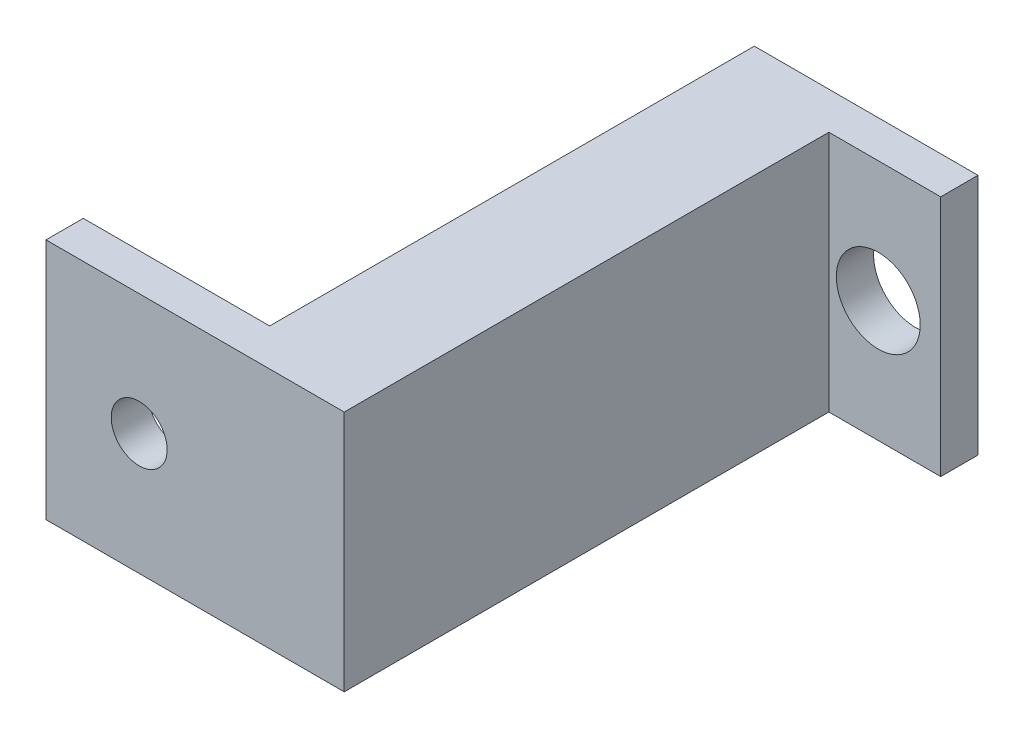
ISO-10303-21;
HEADER;
FILE_DESCRIPTION(('STEP AP214'),'2;1');
FILE_NAME('part.step','',(''),(''),'','','');
FILE_SCHEMA(('AUTOMOTIVE_DESIGN { 1 0 10303 214 1 1 1 1 }'));
ENDSEC;
DATA;
#1=APPLICATION_CONTEXT('core data for automotive mechanical design processes');
#2=APPLICATION_PROTOCOL_DEFINITION('international standard','automotive_design',2000,#1);
#3=PRODUCT_CONTEXT('',#1,'mechanical');
#4=PRODUCT('Part','Part','',(#3));
#5=PRODUCT_RELATED_PRODUCT_CATEGORY('part','',(#4));
#6=PRODUCT_DEFINITION_FORMATION('','',#4);
#7=PRODUCT_DEFINITION_CONTEXT('part definition',#1,'design');
#8=PRODUCT_DEFINITION('design','',#6,#7);
#9=PRODUCT_DEFINITION_SHAPE('','',#8);
#10=(LENGTH_UNIT() NAMED_UNIT(*) SI_UNIT(.MILLI.,.METRE.));
#11=(NAMED_UNIT(*) PLANE_ANGLE_UNIT() SI_UNIT($,.RADIAN.));
#12=(NAMED_UNIT(*) SI_UNIT($,.STERADIAN.) SOLID_ANGLE_UNIT());
#13=UNCERTAINTY_MEASURE_WITH_UNIT(LENGTH_MEASURE(1.E-05),#10,'distance_accuracy_value','');
#14=(GEOMETRIC_REPRESENTATION_CONTEXT(3) GLOBAL_UNCERTAINTY_ASSIGNED_CONTEXT((#13)) GLOBAL_UNIT_ASSIGNED_CONTEXT((#10,
#11,#12)) REPRESENTATION_CONTEXT('',''));
#15=CARTESIAN_POINT('',(0.,0.,0.));
#16=DIRECTION('',(0.,0.,1.));
#17=DIRECTION('',(1.,0.,0.));
#18=AXIS2_PLACEMENT_3D('',#15,#16,#17);
#19=CARTESIAN_POINT('',(0.,0.,2.));
#20=DIRECTION('',(0.,0.,-1.));
#21=DIRECTION('',(-1.,0.,0.));
#22=AXIS2_PLACEMENT_3D('',#19,#20,#21);
#23=PLANE('',#22);
#24=CARTESIAN_POINT('',(2.65,0.,2.));
#25=DIRECTION('',(0.,0.,1.));
#26=DIRECTION('',(1.,0.,0.));
#27=AXIS2_PLACEMENT_3D('',#24,#25,#26);
#28=CIRCLE('',#27,2.25);
#29=CARTESIAN_POINT('',(4.9,0.,2.));
#30=VERTEX_POINT('',#29);
#31=EDGE_CURVE('E105',#30,#30,#28,.T.);
#32=ORIENTED_EDGE('',*,*,#31,.F.);
#33=EDGE_LOOP('',(#32));
#34=FACE_BOUND('',#33,.T.);
#35=DIRECTION('',(0.,1.,0.));
#36=VECTOR('',#35,1.);
#37=CARTESIAN_POINT('',(0.,6.5,2.));
#38=LINE('',#37,#36);
#39=CARTESIAN_POINT('',(0.,-6.5,2.));
#40=VERTEX_POINT('',#39);
#41=CARTESIAN_POINT('',(0.,6.5,2.));
#42=VERTEX_POINT('',#41);
#43=EDGE_CURVE('E55',#40,#42,#38,.T.);
#44=ORIENTED_EDGE('',*,*,#43,.F.);
#45=DIRECTION('',(1.,0.,0.));
#46=VECTOR('',#45,1.);
#47=CARTESIAN_POINT('',(-6.,-6.5,2.));
#48=LINE('',#47,#46);
#49=CARTESIAN_POINT('',(6.,-6.5,2.));
#50=VERTEX_POINT('',#49);
#51=EDGE_CURVE('E60',#40,#50,#48,.T.);
#52=ORIENTED_EDGE('',*,*,#51,.T.);
#53=DIRECTION('',(0.,1.,0.));
#54=VECTOR('',#53,1.);
#55=CARTESIAN_POINT('',(6.,-6.5,2.));
#56=LINE('',#55,#54);
#57=CARTESIAN_POINT('',(6.,6.5,2.));
#58=VERTEX_POINT('',#57);
#59=EDGE_CURVE('E92',#50,#58,#56,.T.);
#60=ORIENTED_EDGE('',*,*,#59,.T.);
#61=DIRECTION('',(-1.,0.,0.));
#62=VECTOR('',#61,1.);
#63=CARTESIAN_POINT('',(-6.,6.5,2.));
#64=LINE('',#63,#62);
#65=EDGE_CURVE('E214',#58,#42,#64,.T.);
#66=ORIENTED_EDGE('',*,*,#65,.T.);
#67=EDGE_LOOP('',(#44,#52,#60,#66));
#68=FACE_BOUND('',#67,.T.);
#69=ADVANCED_FACE('F39',(#34,#68),#23,.F.);
#70=CARTESIAN_POINT('',(0.,0.,0.));
#71=DIRECTION('',(0.,0.,-1.));
#72=DIRECTION('',(-1.,0.,0.));
#73=AXIS2_PLACEMENT_3D('',#70,#71,#72);
#74=PLANE('',#73);
#75=DIRECTION('',(0.,1.,0.));
#76=VECTOR('',#75,1.);
#77=CARTESIAN_POINT('',(6.,-6.5,0.));
#78=LINE('',#77,#76);
#79=CARTESIAN_POINT('',(6.,-6.5,0.));
#80=VERTEX_POINT('',#79);
#81=CARTESIAN_POINT('',(6.,6.5,0.));
#82=VERTEX_POINT('',#81);
#83=EDGE_CURVE('E98',#80,#82,#78,.T.);
#84=ORIENTED_EDGE('',*,*,#83,.F.);
#85=DIRECTION('',(1.,0.,0.));
#86=VECTOR('',#85,1.);
#87=CARTESIAN_POINT('',(-6.,-6.5,0.));
#88=LINE('',#87,#86);
#89=CARTESIAN_POINT('',(-6.,-6.5,0.));
#90=VERTEX_POINT('',#89);
#91=EDGE_CURVE('E80',#90,#80,#88,.T.);
#92=ORIENTED_EDGE('',*,*,#91,.F.);
#93=DIRECTION('',(0.,-1.,0.));
#94=VECTOR('',#93,1.);
#95=CARTESIAN_POINT('',(-6.,-6.5,0.));
#96=LINE('',#95,#94);
#97=CARTESIAN_POINT('',(-6.,6.5,0.));
#98=VERTEX_POINT('',#97);
#99=EDGE_CURVE('E93',#98,#90,#96,.T.);
#100=ORIENTED_EDGE('',*,*,#99,.F.);
#101=DIRECTION('',(-1.,0.,0.));
#102=VECTOR('',#101,1.);
#103=CARTESIAN_POINT('',(-6.,6.5,0.));
#104=LINE('',#103,#102);
#105=EDGE_CURVE('E103',#82,#98,#104,.T.);
#106=ORIENTED_EDGE('',*,*,#105,.F.);
#107=EDGE_LOOP('',(#84,#92,#100,#106));
#108=FACE_BOUND('',#107,.T.);
#109=CARTESIAN_POINT('',(2.65,0.,0.));
#110=DIRECTION('',(0.,0.,1.));
#111=DIRECTION('',(1.,0.,0.));
#112=AXIS2_PLACEMENT_3D('',#109,#110,#111);
#113=CIRCLE('',#112,2.25);
#114=CARTESIAN_POINT('',(4.9,0.,0.));
#115=VERTEX_POINT('',#114);
#116=EDGE_CURVE('E111',#115,#115,#113,.T.);
#117=ORIENTED_EDGE('',*,*,#116,.T.);
#118=EDGE_LOOP('',(#117));
#119=FACE_BOUND('',#118,.T.);
#120=ADVANCED_FACE('F101',(#108,#119),#74,.T.);
#121=CARTESIAN_POINT('',(6.,-6.5,2.));
#122=DIRECTION('',(-1.,0.,0.));
#123=DIRECTION('',(0.,0.,1.));
#124=AXIS2_PLACEMENT_3D('',#121,#122,#123);
#125=PLANE('',#124);
#126=ORIENTED_EDGE('',*,*,#83,.T.);
#127=DIRECTION('',(0.,0.,-1.));
#128=VECTOR('',#127,1.);
#129=CARTESIAN_POINT('',(6.,6.5,2.));
#130=LINE('',#129,#128);
#131=EDGE_CURVE('E11',#58,#82,#130,.T.);
#132=ORIENTED_EDGE('',*,*,#131,.F.);
#133=ORIENTED_EDGE('',*,*,#59,.F.);
#134=DIRECTION('',(0.,0.,-1.));
#135=VECTOR('',#134,1.);
#136=CARTESIAN_POINT('',(6.,-6.5,2.));
#137=LINE('',#136,#135);
#138=EDGE_CURVE('E83',#50,#80,#137,.T.);
#139=ORIENTED_EDGE('',*,*,#138,.T.);
#140=EDGE_LOOP('',(#126,#132,#133,#139));
#141=FACE_BOUND('',#140,.T.);
#142=ADVANCED_FACE('F41',(#141),#125,.F.);
#143=CARTESIAN_POINT('',(-6.,6.5,2.));
#144=DIRECTION('',(0.,-1.,0.));
#145=DIRECTION('',(0.,0.,-1.));
#146=AXIS2_PLACEMENT_3D('',#143,#144,#145);
#147=PLANE('',#146);
#148=ORIENTED_EDGE('',*,*,#105,.T.);
#149=DIRECTION('',(0.,0.,-1.));
#150=VECTOR('',#149,1.);
#151=CARTESIAN_POINT('',(-6.,6.5,2.));
#152=LINE('',#151,#150);
#153=CARTESIAN_POINT('',(-6.,6.5,26.));
#154=VERTEX_POINT('',#153);
#155=EDGE_CURVE('E48',#154,#98,#152,.T.);
#156=ORIENTED_EDGE('',*,*,#155,.F.);
#157=DIRECTION('',(-1.,0.,0.));
#158=VECTOR('',#157,1.);
#159=CARTESIAN_POINT('',(0.,6.5,26.));
#160=LINE('',#159,#158);
#161=CARTESIAN_POINT('',(-16.,6.5,26.));
#162=VERTEX_POINT('',#161);
#163=EDGE_CURVE('E133',#154,#162,#160,.T.);
#164=ORIENTED_EDGE('',*,*,#163,.T.);
#165=DIRECTION('',(0.,0.,-1.));
#166=VECTOR('',#165,1.);
#167=CARTESIAN_POINT('',(-16.,6.5,28.));
#168=LINE('',#167,#166);
#169=CARTESIAN_POINT('',(-16.,6.5,28.));
#170=VERTEX_POINT('',#169);
#171=EDGE_CURVE('E168',#170,#162,#168,.T.);
#172=ORIENTED_EDGE('',*,*,#171,.F.);
#173=DIRECTION('',(-1.,0.,0.));
#174=VECTOR('',#173,1.);
#175=CARTESIAN_POINT('',(0.,6.5,28.));
#176=LINE('',#175,#174);
#177=CARTESIAN_POINT('',(0.,6.5,28.));
#178=VERTEX_POINT('',#177);
#179=EDGE_CURVE('E167',#178,#170,#176,.T.);
#180=ORIENTED_EDGE('',*,*,#179,.F.);
#181=DIRECTION('',(0.,0.,-1.));
#182=VECTOR('',#181,1.);
#183=CARTESIAN_POINT('',(0.,6.5,26.));
#184=LINE('',#183,#182);
#185=EDGE_CURVE('E158',#178,#42,#184,.T.);
#186=ORIENTED_EDGE('',*,*,#185,.T.);
#187=ORIENTED_EDGE('',*,*,#65,.F.);
#188=ORIENTED_EDGE('',*,*,#131,.T.);
#189=EDGE_LOOP('',(#148,#156,#164,#172,#180,#186,#187,#188));
#190=FACE_BOUND('',#189,.T.);
#191=ADVANCED_FACE('F130',(#190),#147,.F.);
#192=CARTESIAN_POINT('',(-6.,-6.5,2.));
#193=DIRECTION('',(1.,0.,0.));
#194=DIRECTION('',(0.,0.,-1.));
#195=AXIS2_PLACEMENT_3D('',#192,#193,#194);
#196=PLANE('',#195);
#197=ORIENTED_EDGE('',*,*,#99,.T.);
#198=DIRECTION('',(0.,0.,-1.));
#199=VECTOR('',#198,1.);
#200=CARTESIAN_POINT('',(-6.,-6.5,2.));
#201=LINE('',#200,#199);
#202=CARTESIAN_POINT('',(-6.,-6.5,26.));
#203=VERTEX_POINT('',#202);
#204=EDGE_CURVE('E87',#203,#90,#201,.T.);
#205=ORIENTED_EDGE('',*,*,#204,.F.);
#206=DIRECTION('',(0.,-1.,0.));
#207=VECTOR('',#206,1.);
#208=CARTESIAN_POINT('',(-6.,6.5,26.));
#209=LINE('',#208,#207);
#210=EDGE_CURVE('E126',#154,#203,#209,.T.);
#211=ORIENTED_EDGE('',*,*,#210,.F.);
#212=ORIENTED_EDGE('',*,*,#155,.T.);
#213=EDGE_LOOP('',(#197,#205,#211,#212));
#214=FACE_BOUND('',#213,.T.);
#215=ADVANCED_FACE('F124',(#214),#196,.F.);
#216=CARTESIAN_POINT('',(-6.,-6.5,2.));
#217=DIRECTION('',(0.,1.,0.));
#218=DIRECTION('',(0.,0.,1.));
#219=AXIS2_PLACEMENT_3D('',#216,#217,#218);
#220=PLANE('',#219);
#221=ORIENTED_EDGE('',*,*,#91,.T.);
#222=ORIENTED_EDGE('',*,*,#138,.F.);
#223=ORIENTED_EDGE('',*,*,#51,.F.);
#224=DIRECTION('',(0.,0.,-1.));
#225=VECTOR('',#224,1.);
#226=CARTESIAN_POINT('',(0.,-6.5,26.));
#227=LINE('',#226,#225);
#228=CARTESIAN_POINT('',(0.,-6.5,28.));
#229=VERTEX_POINT('',#228);
#230=EDGE_CURVE('E165',#229,#40,#227,.T.);
#231=ORIENTED_EDGE('',*,*,#230,.F.);
#232=DIRECTION('',(1.,0.,0.));
#233=VECTOR('',#232,1.);
#234=CARTESIAN_POINT('',(0.,-6.5,28.));
#235=LINE('',#234,#233);
#236=CARTESIAN_POINT('',(-16.,-6.5,28.));
#237=VERTEX_POINT('',#236);
#238=EDGE_CURVE('E178',#237,#229,#235,.T.);
#239=ORIENTED_EDGE('',*,*,#238,.F.);
#240=DIRECTION('',(0.,0.,-1.));
#241=VECTOR('',#240,1.);
#242=CARTESIAN_POINT('',(-16.,-6.5,28.));
#243=LINE('',#242,#241);
#244=CARTESIAN_POINT('',(-16.,-6.5,26.));
#245=VERTEX_POINT('',#244);
#246=EDGE_CURVE('E193',#237,#245,#243,.T.);
#247=ORIENTED_EDGE('',*,*,#246,.T.);
#248=DIRECTION('',(1.,0.,0.));
#249=VECTOR('',#248,1.);
#250=CARTESIAN_POINT('',(0.,-6.5,26.));
#251=LINE('',#250,#249);
#252=EDGE_CURVE('E180',#245,#203,#251,.T.);
#253=ORIENTED_EDGE('',*,*,#252,.T.);
#254=ORIENTED_EDGE('',*,*,#204,.T.);
#255=EDGE_LOOP('',(#221,#222,#223,#231,#239,#247,#253,#254));
#256=FACE_BOUND('',#255,.T.);
#257=ADVANCED_FACE('F82',(#256),#220,.F.);
#258=CARTESIAN_POINT('',(2.65,0.,2.));
#259=DIRECTION('',(0.,0.,-1.));
#260=DIRECTION('',(-1.,0.,0.));
#261=AXIS2_PLACEMENT_3D('',#258,#259,#260);
#262=CYLINDRICAL_SURFACE('',#261,2.25);
#263=ORIENTED_EDGE('',*,*,#31,.T.);
#264=EDGE_LOOP('',(#263));
#265=FACE_BOUND('',#264,.T.);
#266=ORIENTED_EDGE('',*,*,#116,.F.);
#267=EDGE_LOOP('',(#266));
#268=FACE_BOUND('',#267,.T.);
#269=ADVANCED_FACE('F226',(#265,#268),#262,.F.);
#270=CARTESIAN_POINT('',(0.,6.5,26.));
#271=DIRECTION('',(-1.,0.,0.));
#272=DIRECTION('',(0.,-1.,0.));
#273=AXIS2_PLACEMENT_3D('',#270,#271,#272);
#274=PLANE('',#273);
#275=ORIENTED_EDGE('',*,*,#43,.T.);
#276=ORIENTED_EDGE('',*,*,#185,.F.);
#277=DIRECTION('',(0.,1.,0.));
#278=VECTOR('',#277,1.);
#279=CARTESIAN_POINT('',(0.,6.5,28.));
#280=LINE('',#279,#278);
#281=EDGE_CURVE('E163',#229,#178,#280,.T.);
#282=ORIENTED_EDGE('',*,*,#281,.F.);
#283=ORIENTED_EDGE('',*,*,#230,.T.);
#284=EDGE_LOOP('',(#275,#276,#282,#283));
#285=FACE_BOUND('',#284,.T.);
#286=ADVANCED_FACE('F160',(#285),#274,.F.);
#287=CARTESIAN_POINT('',(0.,0.,28.));
#288=DIRECTION('',(0.,0.,-1.));
#289=DIRECTION('',(-1.,0.,0.));
#290=AXIS2_PLACEMENT_3D('',#287,#288,#289);
#291=PLANE('',#290);
#292=ORIENTED_EDGE('',*,*,#281,.T.);
#293=ORIENTED_EDGE('',*,*,#179,.T.);
#294=DIRECTION('',(0.,-1.,0.));
#295=VECTOR('',#294,1.);
#296=CARTESIAN_POINT('',(-16.,6.5,28.));
#297=LINE('',#296,#295);
#298=EDGE_CURVE('E172',#170,#237,#297,.T.);
#299=ORIENTED_EDGE('',*,*,#298,.T.);
#300=ORIENTED_EDGE('',*,*,#238,.T.);
#301=EDGE_LOOP('',(#292,#293,#299,#300));
#302=FACE_BOUND('',#301,.T.);
#303=CARTESIAN_POINT('',(-11.,0.,28.));
#304=DIRECTION('',(0.,0.,1.));
#305=DIRECTION('',(1.,0.,0.));
#306=AXIS2_PLACEMENT_3D('',#303,#304,#305);
#307=CIRCLE('',#306,1.5);
#308=CARTESIAN_POINT('',(-9.5,0.,28.));
#309=VERTEX_POINT('',#308);
#310=EDGE_CURVE('E196',#309,#309,#307,.T.);
#311=ORIENTED_EDGE('',*,*,#310,.F.);
#312=EDGE_LOOP('',(#311));
#313=FACE_BOUND('',#312,.T.);
#314=ADVANCED_FACE('F175',(#302,#313),#291,.F.);
#315=CARTESIAN_POINT('',(0.,0.,26.));
#316=DIRECTION('',(0.,0.,-1.));
#317=DIRECTION('',(-1.,0.,0.));
#318=AXIS2_PLACEMENT_3D('',#315,#316,#317);
#319=PLANE('',#318);
#320=ORIENTED_EDGE('',*,*,#163,.F.);
#321=ORIENTED_EDGE('',*,*,#210,.T.);
#322=ORIENTED_EDGE('',*,*,#252,.F.);
#323=DIRECTION('',(0.,-1.,0.));
#324=VECTOR('',#323,1.);
#325=CARTESIAN_POINT('',(-16.,6.5,26.));
#326=LINE('',#325,#324);
#327=EDGE_CURVE('E183',#162,#245,#326,.T.);
#328=ORIENTED_EDGE('',*,*,#327,.F.);
#329=EDGE_LOOP('',(#320,#321,#322,#328));
#330=FACE_BOUND('',#329,.T.);
#331=CARTESIAN_POINT('',(-11.,0.,26.));
#332=DIRECTION('',(0.,0.,1.));
#333=DIRECTION('',(1.,0.,0.));
#334=AXIS2_PLACEMENT_3D('',#331,#332,#333);
#335=CIRCLE('',#334,1.5);
#336=CARTESIAN_POINT('',(-9.5,0.,26.));
#337=VERTEX_POINT('',#336);
#338=EDGE_CURVE('E186',#337,#337,#335,.T.);
#339=ORIENTED_EDGE('',*,*,#338,.T.);
#340=EDGE_LOOP('',(#339));
#341=FACE_BOUND('',#340,.T.);
#342=ADVANCED_FACE('F303',(#330,#341),#319,.T.);
#343=CARTESIAN_POINT('',(-16.,6.5,28.));
#344=DIRECTION('',(1.,0.,0.));
#345=DIRECTION('',(0.,0.,-1.));
#346=AXIS2_PLACEMENT_3D('',#343,#344,#345);
#347=PLANE('',#346);
#348=ORIENTED_EDGE('',*,*,#327,.T.);
#349=ORIENTED_EDGE('',*,*,#246,.F.);
#350=ORIENTED_EDGE('',*,*,#298,.F.);
#351=ORIENTED_EDGE('',*,*,#171,.T.);
#352=EDGE_LOOP('',(#348,#349,#350,#351));
#353=FACE_BOUND('',#352,.T.);
#354=ADVANCED_FACE('F312',(#353),#347,.F.);
#355=CARTESIAN_POINT('',(-11.,0.,28.));
#356=DIRECTION('',(0.,0.,-1.));
#357=DIRECTION('',(-1.,0.,0.));
#358=AXIS2_PLACEMENT_3D('',#355,#356,#357);
#359=CYLINDRICAL_SURFACE('',#358,1.5);
#360=ORIENTED_EDGE('',*,*,#310,.T.);
#361=EDGE_LOOP('',(#360));
#362=FACE_BOUND('',#361,.T.);
#363=ORIENTED_EDGE('',*,*,#338,.F.);
#364=EDGE_LOOP('',(#363));
#365=FACE_BOUND('',#364,.T.);
#366=ADVANCED_FACE('F322',(#362,#365),#359,.F.);
#367=CLOSED_SHELL('',(#69,#120,#142,#191,#215,#257,#269,#286,#314,#342,#354,#366));
#368=MANIFOLD_SOLID_BREP('B2',#367);
#369=ADVANCED_BREP_SHAPE_REPRESENTATION('',(#18,#368),#14);
#370=SHAPE_DEFINITION_REPRESENTATION(#9,#369);
ENDSEC;
END-ISO-10303-21;
